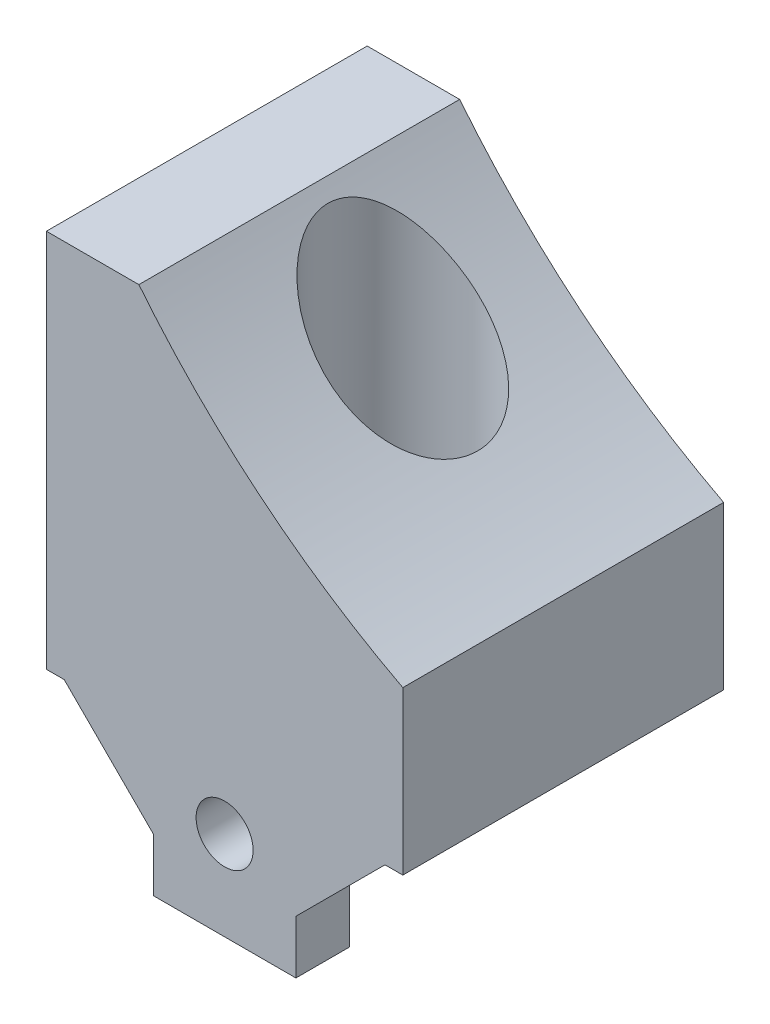
ISO-10303-21;
HEADER;
FILE_DESCRIPTION(('STEP AP214'),'2;1');
FILE_NAME('part.step','',(''),(''),'','','');
FILE_SCHEMA(('AUTOMOTIVE_DESIGN { 1 0 10303 214 1 1 1 1 }'));
ENDSEC;
DATA;
#1=APPLICATION_CONTEXT('core data for automotive mechanical design processes');
#2=APPLICATION_PROTOCOL_DEFINITION('international standard','automotive_design',2000,#1);
#3=PRODUCT_CONTEXT('',#1,'mechanical');
#4=PRODUCT('Part','Part','',(#3));
#5=PRODUCT_RELATED_PRODUCT_CATEGORY('part','',(#4));
#6=PRODUCT_DEFINITION_FORMATION('','',#4);
#7=PRODUCT_DEFINITION_CONTEXT('part definition',#1,'design');
#8=PRODUCT_DEFINITION('design','',#6,#7);
#9=PRODUCT_DEFINITION_SHAPE('','',#8);
#10=(LENGTH_UNIT() NAMED_UNIT(*) SI_UNIT(.MILLI.,.METRE.));
#11=(NAMED_UNIT(*) PLANE_ANGLE_UNIT() SI_UNIT($,.RADIAN.));
#12=(NAMED_UNIT(*) SI_UNIT($,.STERADIAN.) SOLID_ANGLE_UNIT());
#13=UNCERTAINTY_MEASURE_WITH_UNIT(LENGTH_MEASURE(1.E-05),#10,'distance_accuracy_value','');
#14=(GEOMETRIC_REPRESENTATION_CONTEXT(3) GLOBAL_UNCERTAINTY_ASSIGNED_CONTEXT((#13)) GLOBAL_UNIT_ASSIGNED_CONTEXT((#10,
#11,#12)) REPRESENTATION_CONTEXT('',''));
#15=CARTESIAN_POINT('',(0.,0.,0.));
#16=DIRECTION('',(0.,0.,1.));
#17=DIRECTION('',(1.,0.,0.));
#18=AXIS2_PLACEMENT_3D('',#15,#16,#17);
#19=CARTESIAN_POINT('',(0.,0.,18.));
#20=DIRECTION('',(0.,1.,0.));
#21=DIRECTION('',(0.,0.,1.));
#22=AXIS2_PLACEMENT_3D('',#19,#20,#21);
#23=PLANE('',#22);
#24=CARTESIAN_POINT('',(10.,0.,8.));
#25=DIRECTION('',(0.,-1.,0.));
#26=DIRECTION('',(0.,0.,-1.));
#27=AXIS2_PLACEMENT_3D('',#24,#25,#26);
#28=CIRCLE('',#27,4.2);
#29=CARTESIAN_POINT('',(10.,0.,3.8));
#30=VERTEX_POINT('',#29);
#31=EDGE_CURVE('E134',#30,#30,#28,.T.);
#32=ORIENTED_EDGE('',*,*,#31,.F.);
#33=EDGE_LOOP('',(#32));
#34=FACE_BOUND('',#33,.T.);
#35=DIRECTION('',(1.,0.,0.));
#36=VECTOR('',#35,1.);
#37=CARTESIAN_POINT('',(14.,0.,15.));
#38=LINE('',#37,#36);
#39=CARTESIAN_POINT('',(1.00000000000001,0.,15.));
#40=VERTEX_POINT('',#39);
#41=CARTESIAN_POINT('',(19.,0.,15.));
#42=VERTEX_POINT('',#41);
#43=EDGE_CURVE('E49',#40,#42,#38,.T.);
#44=ORIENTED_EDGE('',*,*,#43,.F.);
#45=DIRECTION('',(0.,0.,1.));
#46=VECTOR('',#45,1.);
#47=CARTESIAN_POINT('',(1.00000000000001,0.,18.));
#48=LINE('',#47,#46);
#49=CARTESIAN_POINT('',(1.00000000000001,0.,18.));
#50=VERTEX_POINT('',#49);
#51=EDGE_CURVE('E54',#40,#50,#48,.T.);
#52=ORIENTED_EDGE('',*,*,#51,.T.);
#53=DIRECTION('',(1.,0.,0.));
#54=VECTOR('',#53,1.);
#55=CARTESIAN_POINT('',(0.,0.,18.));
#56=LINE('',#55,#54);
#57=CARTESIAN_POINT('',(0.,0.,18.));
#58=VERTEX_POINT('',#57);
#59=EDGE_CURVE('E169',#58,#50,#56,.T.);
#60=ORIENTED_EDGE('',*,*,#59,.F.);
#61=DIRECTION('',(0.,0.,-1.));
#62=VECTOR('',#61,1.);
#63=CARTESIAN_POINT('',(0.,0.,18.));
#64=LINE('',#63,#62);
#65=CARTESIAN_POINT('',(0.,0.,0.));
#66=VERTEX_POINT('',#65);
#67=EDGE_CURVE('E184',#58,#66,#64,.T.);
#68=ORIENTED_EDGE('',*,*,#67,.T.);
#69=DIRECTION('',(1.,0.,0.));
#70=VECTOR('',#69,1.);
#71=CARTESIAN_POINT('',(0.,0.,0.));
#72=LINE('',#71,#70);
#73=CARTESIAN_POINT('',(20.,0.,0.));
#74=VERTEX_POINT('',#73);
#75=EDGE_CURVE('E210',#66,#74,#72,.T.);
#76=ORIENTED_EDGE('',*,*,#75,.T.);
#77=DIRECTION('',(0.,0.,-1.));
#78=VECTOR('',#77,1.);
#79=CARTESIAN_POINT('',(20.,0.,18.));
#80=LINE('',#79,#78);
#81=CARTESIAN_POINT('',(20.,0.,18.));
#82=VERTEX_POINT('',#81);
#83=EDGE_CURVE('E189',#82,#74,#80,.T.);
#84=ORIENTED_EDGE('',*,*,#83,.F.);
#85=CARTESIAN_POINT('',(19.,0.,18.));
#86=VERTEX_POINT('',#85);
#87=EDGE_CURVE('E158',#86,#82,#56,.T.);
#88=ORIENTED_EDGE('',*,*,#87,.F.);
#89=DIRECTION('',(0.,0.,-1.));
#90=VECTOR('',#89,1.);
#91=CARTESIAN_POINT('',(19.,0.,15.));
#92=LINE('',#91,#90);
#93=EDGE_CURVE('E183',#86,#42,#92,.T.);
#94=ORIENTED_EDGE('',*,*,#93,.T.);
#95=EDGE_LOOP('',(#44,#52,#60,#68,#76,#84,#88,#94));
#96=FACE_BOUND('',#95,.T.);
#97=ADVANCED_FACE('F34',(#34,#96),#23,.F.);
#98=CARTESIAN_POINT('',(0.,0.,18.));
#99=DIRECTION('',(1.,0.,0.));
#100=DIRECTION('',(0.,0.,-1.));
#101=AXIS2_PLACEMENT_3D('',#98,#99,#100);
#102=PLANE('',#101);
#103=DIRECTION('',(0.,-1.,0.));
#104=VECTOR('',#103,1.);
#105=CARTESIAN_POINT('',(0.,0.,0.));
#106=LINE('',#105,#104);
#107=CARTESIAN_POINT('',(0.,21.29,0.));
#108=VERTEX_POINT('',#107);
#109=EDGE_CURVE('E212',#108,#66,#106,.T.);
#110=ORIENTED_EDGE('',*,*,#109,.T.);
#111=ORIENTED_EDGE('',*,*,#67,.F.);
#112=DIRECTION('',(0.,-1.,0.));
#113=VECTOR('',#112,1.);
#114=CARTESIAN_POINT('',(0.,0.,18.));
#115=LINE('',#114,#113);
#116=CARTESIAN_POINT('',(0.,21.29,18.));
#117=VERTEX_POINT('',#116);
#118=EDGE_CURVE('E156',#117,#58,#115,.T.);
#119=ORIENTED_EDGE('',*,*,#118,.F.);
#120=DIRECTION('',(0.,0.,-1.));
#121=VECTOR('',#120,1.);
#122=CARTESIAN_POINT('',(0.,21.29,18.));
#123=LINE('',#122,#121);
#124=EDGE_CURVE('E201',#117,#108,#123,.T.);
#125=ORIENTED_EDGE('',*,*,#124,.T.);
#126=EDGE_LOOP('',(#110,#111,#119,#125));
#127=FACE_BOUND('',#126,.T.);
#128=ADVANCED_FACE('F234',(#127),#102,.F.);
#129=CARTESIAN_POINT('',(20.,0.,18.));
#130=DIRECTION('',(-1.,0.,0.));
#131=DIRECTION('',(0.,0.,1.));
#132=AXIS2_PLACEMENT_3D('',#129,#130,#131);
#133=PLANE('',#132);
#134=DIRECTION('',(0.,1.,0.));
#135=VECTOR('',#134,1.);
#136=CARTESIAN_POINT('',(20.,0.,0.));
#137=LINE('',#136,#135);
#138=CARTESIAN_POINT('',(20.,9.11131998249283,0.));
#139=VERTEX_POINT('',#138);
#140=EDGE_CURVE('E208',#74,#139,#137,.T.);
#141=ORIENTED_EDGE('',*,*,#140,.T.);
#142=DIRECTION('',(0.,0.,-1.));
#143=VECTOR('',#142,1.);
#144=CARTESIAN_POINT('',(20.,9.11131998249283,18.));
#145=LINE('',#144,#143);
#146=CARTESIAN_POINT('',(20.,9.11131998249283,18.));
#147=VERTEX_POINT('',#146);
#148=EDGE_CURVE('E193',#147,#139,#145,.T.);
#149=ORIENTED_EDGE('',*,*,#148,.F.);
#150=DIRECTION('',(0.,1.,0.));
#151=VECTOR('',#150,1.);
#152=CARTESIAN_POINT('',(20.,0.,18.));
#153=LINE('',#152,#151);
#154=EDGE_CURVE('E162',#82,#147,#153,.T.);
#155=ORIENTED_EDGE('',*,*,#154,.F.);
#156=ORIENTED_EDGE('',*,*,#83,.T.);
#157=EDGE_LOOP('',(#141,#149,#155,#156));
#158=FACE_BOUND('',#157,.T.);
#159=ADVANCED_FACE('F222',(#158),#133,.F.);
#160=CARTESIAN_POINT('',(41.82,50.74,18.));
#161=DIRECTION('',(0.,0.,-1.));
#162=DIRECTION('',(-1.,0.,0.));
#163=AXIS2_PLACEMENT_3D('',#160,#161,#162);
#164=CYLINDRICAL_SURFACE('',#163,47.0006319106456);
#165=CARTESIAN_POINT('',(10.,16.1488595157662,3.8));
#166=CARTESIAN_POINT('',(10.2610919827738,15.9086894406283,3.79999660168162));
#167=CARTESIAN_POINT('',(10.5251766661673,15.6712526478669,3.82430504663748));
#168=CARTESIAN_POINT('',(11.0533833822705,15.2069395064922,3.9253526436559));
#169=CARTESIAN_POINT('',(11.317505131178,14.9800751701141,4.00214995249781));
#170=CARTESIAN_POINT('',(11.797016888444,14.5770021626272,4.19646315380797));
#171=CARTESIAN_POINT('',(12.0136346772341,14.398380502343,4.30586148109497));
#172=CARTESIAN_POINT('',(12.4334693690987,14.058070765696,4.56790066570789));
#173=CARTESIAN_POINT('',(12.6367073751546,13.896355774591,4.72047131334826));
#174=CARTESIAN_POINT('',(12.9838822608656,13.6242788472283,5.03681467370189));
#175=CARTESIAN_POINT('',(13.1317256320048,13.5100112452384,5.19286032882952));
#176=CARTESIAN_POINT('',(13.3376811306643,13.3525095038854,5.44816128368588));
#177=CARTESIAN_POINT('',(13.4037268951472,13.3023040650949,5.536849660434));
#178=CARTESIAN_POINT('',(13.5296980043657,13.2070220657892,5.72103908226867));
#179=CARTESIAN_POINT('',(13.5896261259045,13.1619431772593,5.81653700276325));
#180=CARTESIAN_POINT('',(13.7030233883191,13.0770195238951,6.01485841134376));
#181=CARTESIAN_POINT('',(13.7564277798413,13.0372269324842,6.11774139890102));
#182=CARTESIAN_POINT('',(13.855206504869,12.9639029429748,6.3293691398118));
#183=CARTESIAN_POINT('',(13.900585143778,12.930368187334,6.43811070923967));
#184=CARTESIAN_POINT('',(13.9824765259776,12.8700346412125,6.66062427091614));
#185=CARTESIAN_POINT('',(14.0189940546469,12.8432322147098,6.77439350858854));
#186=CARTESIAN_POINT('',(14.0824435703745,12.7967671963842,7.00598751263773));
#187=CARTESIAN_POINT('',(14.1093774092053,12.7771032252453,7.12381149072201));
#188=CARTESIAN_POINT('',(14.1498751661082,12.7475781211538,7.34482959182993));
#189=CARTESIAN_POINT('',(14.1648197467832,12.7367028833451,7.4476381120262));
#190=CARTESIAN_POINT('',(14.1870580326465,12.720529860189,7.65451025303373));
#191=CARTESIAN_POINT('',(14.1943526013253,12.7152314453607,7.75857373085087));
#192=CARTESIAN_POINT('',(14.2011649048693,12.7102831248388,7.96704368134505));
#193=CARTESIAN_POINT('',(14.2006859513544,12.7106308138328,8.07144998902058));
#194=CARTESIAN_POINT('',(14.1919685232786,12.7169634884924,8.27976343528248));
#195=CARTESIAN_POINT('',(14.1837302869887,12.7229483010539,8.38367058909833));
#196=CARTESIAN_POINT('',(14.160596034264,12.7397768590913,8.58187969436635));
#197=CARTESIAN_POINT('',(14.1462837450953,12.750194768432,8.67628647794349));
#198=CARTESIAN_POINT('',(14.1114158748061,12.7756190098332,8.86332288746882));
#199=CARTESIAN_POINT('',(14.0908582045238,12.7906268773061,8.95595190769134));
#200=CARTESIAN_POINT('',(14.020219317583,12.84230810461,9.23019179288676));
#201=CARTESIAN_POINT('',(13.961149358064,12.8856555608064,9.40834570951762));
#202=CARTESIAN_POINT('',(13.8194638403595,12.9903332294536,9.75742588237652));
#203=CARTESIAN_POINT('',(13.73606214464,13.05226623819,9.92784526361172));
#204=CARTESIAN_POINT('',(13.5505068207882,13.1912505195793,10.2513786750597));
#205=CARTESIAN_POINT('',(13.4483466978234,13.2683070291628,10.4044866817024));
#206=CARTESIAN_POINT('',(13.2151451334036,13.4459561613123,10.7100421316888));
#207=CARTESIAN_POINT('',(13.0820825323736,13.5482963474247,10.8599229134059));
#208=CARTESIAN_POINT('',(12.8020719242747,13.7663484939976,11.1348019721772));
#209=CARTESIAN_POINT('',(12.6551139664205,13.8820700505919,11.2597822153068));
#210=CARTESIAN_POINT('',(12.2796658463968,14.1817005467631,11.5384443958669));
#211=CARTESIAN_POINT('',(12.0454728135797,14.3719839822218,11.6777668495096));
#212=CARTESIAN_POINT('',(11.6867842276376,14.6696064427105,11.8486906010441));
#213=CARTESIAN_POINT('',(11.565822867172,14.7709893771484,11.8993636872396));
#214=CARTESIAN_POINT('',(11.3223030387342,14.9772366726889,11.9885212477006));
#215=CARTESIAN_POINT('',(11.1997444263418,15.082101349949,12.0270046117236));
#216=CARTESIAN_POINT('',(10.9229849268337,15.3214279068421,12.1004213845412));
#217=CARTESIAN_POINT('',(10.7685921141049,15.456689753508,12.1320171450345));
#218=CARTESIAN_POINT('',(10.4601506628917,15.7305469500407,12.1776273232692));
#219=CARTESIAN_POINT('',(10.3061021108221,15.8691430522599,12.1916377343429));
#220=CARTESIAN_POINT('',(9.99942439525355,16.1487660831752,12.2028040929992));
#221=CARTESIAN_POINT('',(9.84679635254488,16.2897947159639,12.1999477032507));
#222=CARTESIAN_POINT('',(9.54407300400736,16.573248111915,12.1779374630227));
#223=CARTESIAN_POINT('',(9.39397749103069,16.7156727593693,12.1587849521367));
#224=CARTESIAN_POINT('',(9.09561590172942,17.0025229289473,12.1043061417992));
#225=CARTESIAN_POINT('',(8.9473855861783,17.1469537572106,12.0688121175498));
#226=CARTESIAN_POINT('',(8.65521123987656,17.4353707821119,11.9818063694153));
#227=CARTESIAN_POINT('',(8.51126775703422,17.5793569198232,11.9302926075627));
#228=CARTESIAN_POINT('',(8.22864465296834,17.8656835475881,11.8112724094561));
#229=CARTESIAN_POINT('',(8.08996153483667,18.0080250855367,11.7437768214678));
#230=CARTESIAN_POINT('',(7.81874308519524,18.289851397588,11.5925234800973));
#231=CARTESIAN_POINT('',(7.68620567747541,18.4293371274452,11.5087712690267));
#232=CARTESIAN_POINT('',(7.46484436969556,18.6650731549733,11.3505069307933));
#233=CARTESIAN_POINT('',(7.37425164974594,18.7624022824602,11.2800720117421));
#234=CARTESIAN_POINT('',(7.19734687589825,18.9540225526517,11.1302678728727));
#235=CARTESIAN_POINT('',(7.11103580914534,19.0483129930405,11.0508966064233));
#236=CARTESIAN_POINT('',(6.85970088384712,19.3250605888088,10.7990617034235));
#237=CARTESIAN_POINT('',(6.70182691889584,19.5018734121979,10.6125639464232));
#238=CARTESIAN_POINT('',(6.4556739030371,19.7811910039447,10.2603909862085));
#239=CARTESIAN_POINT('',(6.36057235524858,19.8902690331812,10.1046850221195));
#240=CARTESIAN_POINT('',(6.18792269996806,20.0898486502119,9.7728237695468));
#241=CARTESIAN_POINT('',(6.11034802361486,20.1803783356346,9.59670005389291));
#242=CARTESIAN_POINT('',(5.9918667026221,20.3194339208108,9.26454296967932));
#243=CARTESIAN_POINT('',(5.94667884120009,20.3727901753542,9.11208398697245));
#244=CARTESIAN_POINT('',(5.87329589258817,20.4596907429972,8.79767693518284));
#245=CARTESIAN_POINT('',(5.84508513800652,20.493253322196,8.63573776686792));
#246=CARTESIAN_POINT('',(5.80781567054544,20.537634602919,8.30550378859282));
#247=CARTESIAN_POINT('',(5.79887335022887,20.5483150810251,8.13717656948168));
#248=CARTESIAN_POINT('',(5.80135497239107,20.5453545397332,7.80088984832869));
#249=CARTESIAN_POINT('',(5.81277802073134,20.53171458812,7.63293033046713));
#250=CARTESIAN_POINT('',(5.8529746411114,20.4838715658333,7.31800622358353));
#251=CARTESIAN_POINT('',(5.88008896365085,20.4516357983739,7.17051503829388));
#252=CARTESIAN_POINT('',(5.94840822367702,20.3707540955767,6.8835811070221));
#253=CARTESIAN_POINT('',(5.98961947377267,20.3221008086003,6.74414199951559));
#254=CARTESIAN_POINT('',(6.10500420858492,20.1866131503494,6.41525231284447));
#255=CARTESIAN_POINT('',(6.18568656654111,20.0924206448308,6.23112830117665));
#256=CARTESIAN_POINT('',(6.36615396545136,19.8838300108236,5.8849405317419));
#257=CARTESIAN_POINT('',(6.46598291917779,19.7693854818584,5.72292898004668));
#258=CARTESIAN_POINT('',(6.65114903007863,19.5594718020685,5.4616108567638));
#259=CARTESIAN_POINT('',(6.73310190627082,19.4672435315856,5.35719688910031));
#260=CARTESIAN_POINT('',(6.9035365599492,19.2770650801798,5.15940726546119));
#261=CARTESIAN_POINT('',(6.99202123664226,19.1791123624694,5.0660365595817));
#262=CARTESIAN_POINT('',(7.17465895208709,18.9787316848021,4.88976125699421));
#263=CARTESIAN_POINT('',(7.26882236559884,18.8762956337494,4.80687672939606));
#264=CARTESIAN_POINT('',(7.46188836600029,18.6682099009444,4.65136581511624));
#265=CARTESIAN_POINT('',(7.56079070840602,18.5625603850791,4.57873890000016));
#266=CARTESIAN_POINT('',(7.79669941293931,18.3129593714898,4.42063417922251));
#267=CARTESIAN_POINT('',(7.93533570325578,18.168074281506,4.33904706965079));
#268=CARTESIAN_POINT('',(8.2188359633696,17.8756928334057,4.19304797423477));
#269=CARTESIAN_POINT('',(8.36370259711052,17.7281953744806,4.12864342174224));
#270=CARTESIAN_POINT('',(8.65831306529822,17.4322617820111,4.01695593909805));
#271=CARTESIAN_POINT('',(8.80804623962762,17.2838282075843,3.96963801686054));
#272=CARTESIAN_POINT('',(9.1116749189197,16.9869272718171,3.89203046156109));
#273=CARTESIAN_POINT('',(9.26556792960633,16.838459981426,3.86173085156641));
#274=CARTESIAN_POINT('',(9.51649297525007,16.5996984416,3.82681237547647));
#275=CARTESIAN_POINT('',(9.6125109105903,16.5091004964862,3.8167940536907));
#276=CARTESIAN_POINT('',(9.80554693643163,16.3284946352164,3.80338832695015));
#277=CARTESIAN_POINT('',(9.90256507888456,16.23848675011,3.80000126819245));
#278=CARTESIAN_POINT('',(10.,16.1488595157662,3.8));
#279=B_SPLINE_CURVE_WITH_KNOTS('',3,(#165,#166,#167,#168,#169,#170,#171,#172,#173,#174,#175,
#176,#177,#178,#179,#180,#181,#182,#183,#184,#185,#186,#187,#188,#189,#190,#191,#192,#193,#194,
#195,#196,#197,#198,#199,#200,#201,#202,#203,#204,#205,#206,#207,#208,#209,#210,#211,#212,#213,
#214,#215,#216,#217,#218,#219,#220,#221,#222,#223,#224,#225,#226,#227,#228,#229,#230,#231,#232,
#233,#234,#235,#236,#237,#238,#239,#240,#241,#242,#243,#244,#245,#246,#247,#248,#249,#250,#251,
#252,#253,#254,#255,#256,#257,#258,#259,#260,#261,#262,#263,#264,#265,#266,#267,#268,#269,#270,
#271,#272,#273,#274,#275,#276,#277,#278),.UNSPECIFIED.,.T.,.F.,(4,2,2,2,2,2,2,2,2,2,2,2,2,2,2,2,
2,2,2,2,2,2,2,2,2,2,2,2,2,2,2,2,2,2,2,2,2,2,2,2,2,2,2,2,2,2,2,2,2,2,2,2,2,2,2,2,4),(0.,
1.06391180307652,2.12900431760187,3.02964956997654,3.92883846922963,4.65600381618565,
5.01994805052789,5.38372634880549,5.75086364364609,6.11780338685505,6.48454452365429,
6.85121475974337,7.16416579863786,7.47708150956287,7.7898639178961,8.10263672166243,
8.39045123676593,8.67836213580442,9.25361398015462,9.85002473751626,10.446642384144,
11.1192307091921,11.7923043918026,12.7835439770249,13.2804834056417,13.7774680826023,
14.399675830408,15.0220253170759,15.6448300816816,16.267583654685,16.8968765975414,
17.5262496293217,18.1551966690169,18.7839296595032,19.2349864517375,19.6861467574102,
20.5863037131911,21.2221090788358,21.8569440665694,22.358154298358,22.8589012741007,
23.362664670899,23.8664059505843,24.324676190554,24.7831519133237,25.4454588556864,
26.1093033690869,26.5935812604322,27.0780754111685,27.5634832242167,28.0488660217142,
28.6974630190453,29.3463401528207,29.9938807979104,30.641041427013,31.0380538134591,
31.4350869261011),.UNSPECIFIED.);
#280=CARTESIAN_POINT('',(10.,16.1488595157662,3.8));
#281=VERTEX_POINT('',#280);
#282=EDGE_CURVE('E155',#281,#281,#279,.T.);
#283=ORIENTED_EDGE('',*,*,#282,.T.);
#284=EDGE_LOOP('',(#283));
#285=FACE_BOUND('',#284,.T.);
#286=CARTESIAN_POINT('',(41.82,50.74,0.));
#287=DIRECTION('',(0.,0.,-1.));
#288=DIRECTION('',(1.,0.,0.));
#289=AXIS2_PLACEMENT_3D('',#286,#287,#288);
#290=CIRCLE('',#289,47.0006319106456);
#291=CARTESIAN_POINT('',(5.18999999999999,21.29,0.));
#292=VERTEX_POINT('',#291);
#293=EDGE_CURVE('E206',#139,#292,#290,.T.);
#294=ORIENTED_EDGE('',*,*,#293,.T.);
#295=DIRECTION('',(0.,0.,-1.));
#296=VECTOR('',#295,1.);
#297=CARTESIAN_POINT('',(5.18999999999999,21.29,18.));
#298=LINE('',#297,#296);
#299=CARTESIAN_POINT('',(5.18999999999999,21.29,18.));
#300=VERTEX_POINT('',#299);
#301=EDGE_CURVE('E198',#300,#292,#298,.T.);
#302=ORIENTED_EDGE('',*,*,#301,.F.);
#303=CARTESIAN_POINT('',(41.82,50.74,18.));
#304=DIRECTION('',(0.,0.,-1.));
#305=DIRECTION('',(1.,0.,0.));
#306=AXIS2_PLACEMENT_3D('',#303,#304,#305);
#307=CIRCLE('',#306,47.0006319106456);
#308=EDGE_CURVE('E214',#147,#300,#307,.T.);
#309=ORIENTED_EDGE('',*,*,#308,.F.);
#310=ORIENTED_EDGE('',*,*,#148,.T.);
#311=EDGE_LOOP('',(#294,#302,#309,#310));
#312=FACE_BOUND('',#311,.T.);
#313=ADVANCED_FACE('F226',(#285,#312),#164,.F.);
#314=CARTESIAN_POINT('',(0.,21.29,18.));
#315=DIRECTION('',(0.,-1.,0.));
#316=DIRECTION('',(0.,0.,-1.));
#317=AXIS2_PLACEMENT_3D('',#314,#315,#316);
#318=PLANE('',#317);
#319=DIRECTION('',(-1.,0.,0.));
#320=VECTOR('',#319,1.);
#321=CARTESIAN_POINT('',(0.,21.29,0.));
#322=LINE('',#321,#320);
#323=EDGE_CURVE('E159',#292,#108,#322,.T.);
#324=ORIENTED_EDGE('',*,*,#323,.T.);
#325=ORIENTED_EDGE('',*,*,#124,.F.);
#326=DIRECTION('',(-1.,0.,0.));
#327=VECTOR('',#326,1.);
#328=CARTESIAN_POINT('',(0.,21.29,18.));
#329=LINE('',#328,#327);
#330=EDGE_CURVE('E204',#300,#117,#329,.T.);
#331=ORIENTED_EDGE('',*,*,#330,.F.);
#332=ORIENTED_EDGE('',*,*,#301,.T.);
#333=EDGE_LOOP('',(#324,#325,#331,#332));
#334=FACE_BOUND('',#333,.T.);
#335=ADVANCED_FACE('F231',(#334),#318,.F.);
#336=CARTESIAN_POINT('',(41.82,50.74,18.));
#337=DIRECTION('',(0.,0.,1.));
#338=DIRECTION('',(1.,0.,0.));
#339=AXIS2_PLACEMENT_3D('',#336,#337,#338);
#340=PLANE('',#339);
#341=CARTESIAN_POINT('',(10.,-3.,18.));
#342=DIRECTION('',(0.,0.,1.));
#343=DIRECTION('',(1.,0.,0.));
#344=AXIS2_PLACEMENT_3D('',#341,#342,#343);
#345=CIRCLE('',#344,1.6);
#346=CARTESIAN_POINT('',(11.6,-3.,18.));
#347=VERTEX_POINT('',#346);
#348=EDGE_CURVE('E148',#347,#347,#345,.T.);
#349=ORIENTED_EDGE('',*,*,#348,.F.);
#350=EDGE_LOOP('',(#349));
#351=FACE_BOUND('',#350,.T.);
#352=ORIENTED_EDGE('',*,*,#118,.T.);
#353=ORIENTED_EDGE('',*,*,#59,.T.);
#354=DIRECTION('',(-0.707106781186544,0.707106781186551,0.));
#355=VECTOR('',#354,1.);
#356=CARTESIAN_POINT('',(6.,-5.00000000000004,18.));
#357=LINE('',#356,#355);
#358=CARTESIAN_POINT('',(6.,-5.00000000000004,18.));
#359=VERTEX_POINT('',#358);
#360=EDGE_CURVE('E11',#50,#359,#357,.F.);
#361=ORIENTED_EDGE('',*,*,#360,.T.);
#362=DIRECTION('',(0.,1.,0.));
#363=VECTOR('',#362,1.);
#364=CARTESIAN_POINT('',(6.,-8.,18.));
#365=LINE('',#364,#363);
#366=CARTESIAN_POINT('',(6.,-8.,18.));
#367=VERTEX_POINT('',#366);
#368=EDGE_CURVE('E127',#367,#359,#365,.T.);
#369=ORIENTED_EDGE('',*,*,#368,.F.);
#370=DIRECTION('',(-1.,0.,0.));
#371=VECTOR('',#370,1.);
#372=CARTESIAN_POINT('',(10.,-8.,18.));
#373=LINE('',#372,#371);
#374=CARTESIAN_POINT('',(14.,-8.,18.));
#375=VERTEX_POINT('',#374);
#376=EDGE_CURVE('E114',#375,#367,#373,.T.);
#377=ORIENTED_EDGE('',*,*,#376,.F.);
#378=DIRECTION('',(0.,1.,0.));
#379=VECTOR('',#378,1.);
#380=CARTESIAN_POINT('',(14.,-8.,18.));
#381=LINE('',#380,#379);
#382=CARTESIAN_POINT('',(14.,-5.00000000000004,18.));
#383=VERTEX_POINT('',#382);
#384=EDGE_CURVE('E146',#375,#383,#381,.T.);
#385=ORIENTED_EDGE('',*,*,#384,.T.);
#386=DIRECTION('',(-0.707106781186544,-0.707106781186551,0.));
#387=VECTOR('',#386,1.);
#388=CARTESIAN_POINT('',(14.,-5.00000000000004,18.));
#389=LINE('',#388,#387);
#390=EDGE_CURVE('E187',#383,#86,#389,.F.);
#391=ORIENTED_EDGE('',*,*,#390,.T.);
#392=ORIENTED_EDGE('',*,*,#87,.T.);
#393=ORIENTED_EDGE('',*,*,#154,.T.);
#394=ORIENTED_EDGE('',*,*,#308,.T.);
#395=ORIENTED_EDGE('',*,*,#330,.T.);
#396=EDGE_LOOP('',(#352,#353,#361,#369,#377,#385,#391,#392,#393,#394,#395));
#397=FACE_BOUND('',#396,.T.);
#398=ADVANCED_FACE('F129',(#351,#397),#340,.T.);
#399=CARTESIAN_POINT('',(41.82,50.74,0.));
#400=DIRECTION('',(0.,0.,1.));
#401=DIRECTION('',(1.,0.,0.));
#402=AXIS2_PLACEMENT_3D('',#399,#400,#401);
#403=PLANE('',#402);
#404=ORIENTED_EDGE('',*,*,#109,.F.);
#405=ORIENTED_EDGE('',*,*,#323,.F.);
#406=ORIENTED_EDGE('',*,*,#293,.F.);
#407=ORIENTED_EDGE('',*,*,#140,.F.);
#408=ORIENTED_EDGE('',*,*,#75,.F.);
#409=EDGE_LOOP('',(#404,#405,#406,#407,#408));
#410=FACE_BOUND('',#409,.T.);
#411=ADVANCED_FACE('F237',(#410),#403,.F.);
#412=CARTESIAN_POINT('',(10.,28.,8.));
#413=DIRECTION('',(0.,-1.,0.));
#414=DIRECTION('',(0.,0.,-1.));
#415=AXIS2_PLACEMENT_3D('',#412,#413,#414);
#416=CYLINDRICAL_SURFACE('',#415,4.2);
#417=ORIENTED_EDGE('',*,*,#31,.T.);
#418=EDGE_LOOP('',(#417));
#419=FACE_BOUND('',#418,.T.);
#420=ORIENTED_EDGE('',*,*,#282,.F.);
#421=EDGE_LOOP('',(#420));
#422=FACE_BOUND('',#421,.T.);
#423=ADVANCED_FACE('F278',(#419,#422),#416,.F.);
#424=CARTESIAN_POINT('',(6.,-8.,15.));
#425=DIRECTION('',(1.,0.,0.));
#426=DIRECTION('',(0.,0.,-1.));
#427=AXIS2_PLACEMENT_3D('',#424,#425,#426);
#428=PLANE('',#427);
#429=ORIENTED_EDGE('',*,*,#368,.T.);
#430=DIRECTION('',(0.,0.,-1.));
#431=VECTOR('',#430,1.);
#432=CARTESIAN_POINT('',(6.,-5.00000000000004,15.));
#433=LINE('',#432,#431);
#434=CARTESIAN_POINT('',(6.,-5.00000000000004,15.));
#435=VERTEX_POINT('',#434);
#436=EDGE_CURVE('E245',#359,#435,#433,.T.);
#437=ORIENTED_EDGE('',*,*,#436,.T.);
#438=DIRECTION('',(0.,1.,0.));
#439=VECTOR('',#438,1.);
#440=CARTESIAN_POINT('',(6.,-8.,15.));
#441=LINE('',#440,#439);
#442=CARTESIAN_POINT('',(6.,-8.,15.));
#443=VERTEX_POINT('',#442);
#444=EDGE_CURVE('E135',#443,#435,#441,.T.);
#445=ORIENTED_EDGE('',*,*,#444,.F.);
#446=DIRECTION('',(0.,0.,-1.));
#447=VECTOR('',#446,1.);
#448=CARTESIAN_POINT('',(6.,-8.,15.));
#449=LINE('',#448,#447);
#450=EDGE_CURVE('E118',#367,#443,#449,.T.);
#451=ORIENTED_EDGE('',*,*,#450,.F.);
#452=EDGE_LOOP('',(#429,#437,#445,#451));
#453=FACE_BOUND('',#452,.T.);
#454=ADVANCED_FACE('F137',(#453),#428,.F.);
#455=CARTESIAN_POINT('',(14.,-8.,15.));
#456=DIRECTION('',(0.,0.,1.));
#457=DIRECTION('',(1.,0.,0.));
#458=AXIS2_PLACEMENT_3D('',#455,#456,#457);
#459=PLANE('',#458);
#460=CARTESIAN_POINT('',(10.,-3.,15.));
#461=DIRECTION('',(0.,0.,-1.));
#462=DIRECTION('',(-1.,0.,0.));
#463=AXIS2_PLACEMENT_3D('',#460,#461,#462);
#464=CIRCLE('',#463,1.6);
#465=CARTESIAN_POINT('',(8.4,-3.,15.));
#466=VERTEX_POINT('',#465);
#467=EDGE_CURVE('E388',#466,#466,#464,.T.);
#468=ORIENTED_EDGE('',*,*,#467,.F.);
#469=EDGE_LOOP('',(#468));
#470=FACE_BOUND('',#469,.T.);
#471=ORIENTED_EDGE('',*,*,#43,.T.);
#472=DIRECTION('',(0.707106781186544,0.707106781186551,0.));
#473=VECTOR('',#472,1.);
#474=CARTESIAN_POINT('',(12.5,-6.50000000000003,15.));
#475=LINE('',#474,#473);
#476=CARTESIAN_POINT('',(14.,-5.00000000000004,15.));
#477=VERTEX_POINT('',#476);
#478=EDGE_CURVE('E242',#42,#477,#475,.F.);
#479=ORIENTED_EDGE('',*,*,#478,.T.);
#480=DIRECTION('',(0.,1.,0.));
#481=VECTOR('',#480,1.);
#482=CARTESIAN_POINT('',(14.,-8.,15.));
#483=LINE('',#482,#481);
#484=CARTESIAN_POINT('',(14.,-8.,15.));
#485=VERTEX_POINT('',#484);
#486=EDGE_CURVE('E149',#485,#477,#483,.T.);
#487=ORIENTED_EDGE('',*,*,#486,.F.);
#488=DIRECTION('',(1.,0.,0.));
#489=VECTOR('',#488,1.);
#490=CARTESIAN_POINT('',(14.,-8.,15.));
#491=LINE('',#490,#489);
#492=EDGE_CURVE('E140',#443,#485,#491,.T.);
#493=ORIENTED_EDGE('',*,*,#492,.F.);
#494=ORIENTED_EDGE('',*,*,#444,.T.);
#495=DIRECTION('',(0.707106781186544,-0.707106781186551,0.));
#496=VECTOR('',#495,1.);
#497=CARTESIAN_POINT('',(11.4999999999999,-10.5,15.));
#498=LINE('',#497,#496);
#499=EDGE_CURVE('E42',#435,#40,#498,.F.);
#500=ORIENTED_EDGE('',*,*,#499,.T.);
#501=EDGE_LOOP('',(#471,#479,#487,#493,#494,#500));
#502=FACE_BOUND('',#501,.T.);
#503=ADVANCED_FACE('F250',(#470,#502),#459,.F.);
#504=CARTESIAN_POINT('',(14.,-8.,18.));
#505=DIRECTION('',(-1.,0.,0.));
#506=DIRECTION('',(0.,0.,1.));
#507=AXIS2_PLACEMENT_3D('',#504,#505,#506);
#508=PLANE('',#507);
#509=ORIENTED_EDGE('',*,*,#486,.T.);
#510=DIRECTION('',(0.,0.,1.));
#511=VECTOR('',#510,1.);
#512=CARTESIAN_POINT('',(14.,-5.00000000000004,18.));
#513=LINE('',#512,#511);
#514=EDGE_CURVE('E181',#477,#383,#513,.T.);
#515=ORIENTED_EDGE('',*,*,#514,.T.);
#516=ORIENTED_EDGE('',*,*,#384,.F.);
#517=DIRECTION('',(0.,0.,1.));
#518=VECTOR('',#517,1.);
#519=CARTESIAN_POINT('',(14.,-8.,18.));
#520=LINE('',#519,#518);
#521=EDGE_CURVE('E121',#485,#375,#520,.T.);
#522=ORIENTED_EDGE('',*,*,#521,.F.);
#523=EDGE_LOOP('',(#509,#515,#516,#522));
#524=FACE_BOUND('',#523,.T.);
#525=ADVANCED_FACE('F289',(#524),#508,.F.);
#526=CARTESIAN_POINT('',(0.,-8.,0.));
#527=DIRECTION('',(0.,1.,0.));
#528=DIRECTION('',(0.,0.,1.));
#529=AXIS2_PLACEMENT_3D('',#526,#527,#528);
#530=PLANE('',#529);
#531=ORIENTED_EDGE('',*,*,#376,.T.);
#532=ORIENTED_EDGE('',*,*,#450,.T.);
#533=ORIENTED_EDGE('',*,*,#492,.T.);
#534=ORIENTED_EDGE('',*,*,#521,.T.);
#535=EDGE_LOOP('',(#531,#532,#533,#534));
#536=FACE_BOUND('',#535,.T.);
#537=ADVANCED_FACE('F116',(#536),#530,.F.);
#538=CARTESIAN_POINT('',(14.,-5.00000000000004,18.));
#539=DIRECTION('',(0.707106781186551,-0.707106781186544,0.));
#540=DIRECTION('',(0.,0.,-1.));
#541=AXIS2_PLACEMENT_3D('',#538,#539,#540);
#542=PLANE('',#541);
#543=ORIENTED_EDGE('',*,*,#478,.F.);
#544=ORIENTED_EDGE('',*,*,#93,.F.);
#545=ORIENTED_EDGE('',*,*,#390,.F.);
#546=ORIENTED_EDGE('',*,*,#514,.F.);
#547=EDGE_LOOP('',(#543,#544,#545,#546));
#548=FACE_BOUND('',#547,.T.);
#549=ADVANCED_FACE('F241',(#548),#542,.T.);
#550=CARTESIAN_POINT('',(6.,-5.00000000000004,15.));
#551=DIRECTION('',(-0.707106781186551,-0.707106781186544,0.));
#552=DIRECTION('',(0.,0.,1.));
#553=AXIS2_PLACEMENT_3D('',#550,#551,#552);
#554=PLANE('',#553);
#555=ORIENTED_EDGE('',*,*,#360,.F.);
#556=ORIENTED_EDGE('',*,*,#51,.F.);
#557=ORIENTED_EDGE('',*,*,#499,.F.);
#558=ORIENTED_EDGE('',*,*,#436,.F.);
#559=EDGE_LOOP('',(#555,#556,#557,#558));
#560=FACE_BOUND('',#559,.T.);
#561=ADVANCED_FACE('F36',(#560),#554,.T.);
#562=CARTESIAN_POINT('',(10.,-3.,23.));
#563=DIRECTION('',(0.,0.,-1.));
#564=DIRECTION('',(-1.,0.,0.));
#565=AXIS2_PLACEMENT_3D('',#562,#563,#564);
#566=CYLINDRICAL_SURFACE('',#565,1.6);
#567=ORIENTED_EDGE('',*,*,#348,.T.);
#568=EDGE_LOOP('',(#567));
#569=FACE_BOUND('',#568,.T.);
#570=ORIENTED_EDGE('',*,*,#467,.T.);
#571=EDGE_LOOP('',(#570));
#572=FACE_BOUND('',#571,.T.);
#573=ADVANCED_FACE('F253',(#569,#572),#566,.F.);
#574=CLOSED_SHELL('',(#97,#128,#159,#313,#335,#398,#411,#423,#454,#503,#525,#537,#549,#561,#573));
#575=MANIFOLD_SOLID_BREP('B2',#574);
#576=ADVANCED_BREP_SHAPE_REPRESENTATION('',(#18,#575),#14);
#577=SHAPE_DEFINITION_REPRESENTATION(#9,#576);
ENDSEC;
END-ISO-10303-21;
